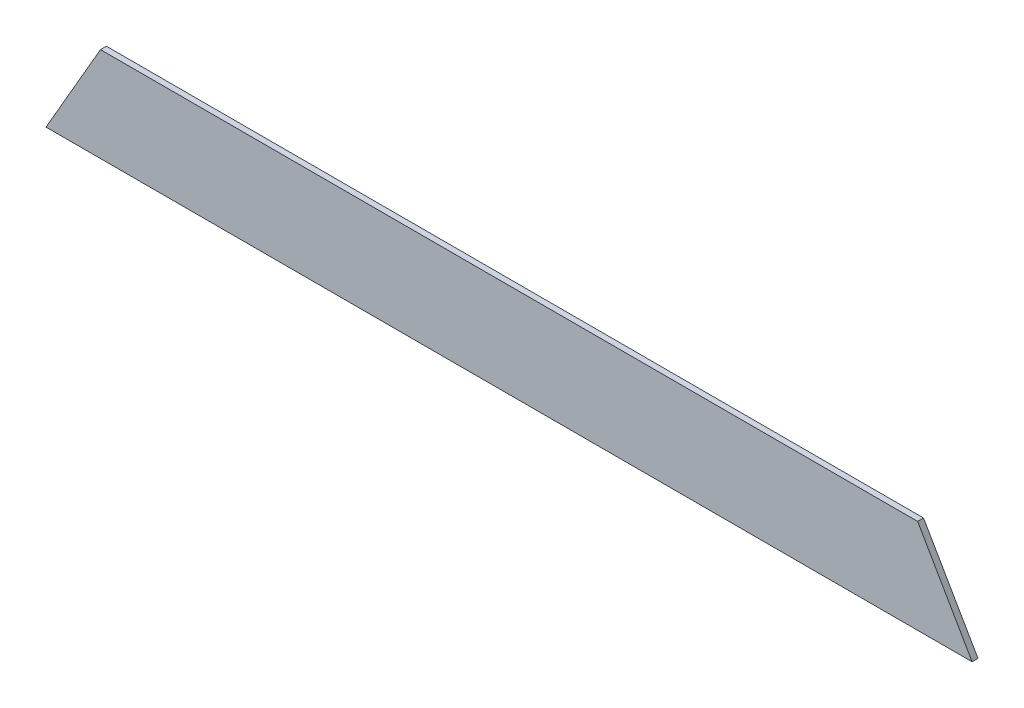
ISO-10303-21;
HEADER;
FILE_DESCRIPTION(('STEP AP214'),'2;1');
FILE_NAME('part.step','',(''),(''),'','','');
FILE_SCHEMA(('AUTOMOTIVE_DESIGN { 1 0 10303 214 1 1 1 1 }'));
ENDSEC;
DATA;
#1=APPLICATION_CONTEXT('core data for automotive mechanical design processes');
#2=APPLICATION_PROTOCOL_DEFINITION('international standard','automotive_design',2000,#1);
#3=PRODUCT_CONTEXT('',#1,'mechanical');
#4=PRODUCT('Part','Part','',(#3));
#5=PRODUCT_RELATED_PRODUCT_CATEGORY('part','',(#4));
#6=PRODUCT_DEFINITION_FORMATION('','',#4);
#7=PRODUCT_DEFINITION_CONTEXT('part definition',#1,'design');
#8=PRODUCT_DEFINITION('design','',#6,#7);
#9=PRODUCT_DEFINITION_SHAPE('','',#8);
#10=(LENGTH_UNIT() NAMED_UNIT(*) SI_UNIT(.MILLI.,.METRE.));
#11=(NAMED_UNIT(*) PLANE_ANGLE_UNIT() SI_UNIT($,.RADIAN.));
#12=(NAMED_UNIT(*) SI_UNIT($,.STERADIAN.) SOLID_ANGLE_UNIT());
#13=UNCERTAINTY_MEASURE_WITH_UNIT(LENGTH_MEASURE(1.E-05),#10,'distance_accuracy_value','');
#14=(GEOMETRIC_REPRESENTATION_CONTEXT(3) GLOBAL_UNCERTAINTY_ASSIGNED_CONTEXT((#13)) GLOBAL_UNIT_ASSIGNED_CONTEXT((#10,
#11,#12)) REPRESENTATION_CONTEXT('',''));
#15=CARTESIAN_POINT('',(0.,0.,0.));
#16=DIRECTION('',(0.,0.,1.));
#17=DIRECTION('',(1.,0.,0.));
#18=AXIS2_PLACEMENT_3D('',#15,#16,#17);
#19=CARTESIAN_POINT('',(0.,0.,3.175));
#20=DIRECTION('',(0.,1.,0.));
#21=DIRECTION('',(0.,0.,1.));
#22=AXIS2_PLACEMENT_3D('',#19,#20,#21);
#23=PLANE('',#22);
#24=DIRECTION('',(1.,0.,0.));
#25=VECTOR('',#24,1.);
#26=CARTESIAN_POINT('',(0.,0.,0.));
#27=LINE('',#26,#25);
#28=CARTESIAN_POINT('',(-29.3293936748326,0.,0.));
#29=VERTEX_POINT('',#28);
#30=CARTESIAN_POINT('',(469.282793674833,0.,0.));
#31=VERTEX_POINT('',#30);
#32=EDGE_CURVE('E80',#29,#31,#27,.T.);
#33=ORIENTED_EDGE('',*,*,#32,.T.);
#34=DIRECTION('',(0.,0.,1.));
#35=VECTOR('',#34,1.);
#36=CARTESIAN_POINT('',(469.282793674833,0.,-58.6587873496658));
#37=LINE('',#36,#35);
#38=CARTESIAN_POINT('',(469.282793674833,0.,3.175));
#39=VERTEX_POINT('',#38);
#40=EDGE_CURVE('E79',#31,#39,#37,.T.);
#41=ORIENTED_EDGE('',*,*,#40,.T.);
#42=DIRECTION('',(1.,0.,0.));
#43=VECTOR('',#42,1.);
#44=CARTESIAN_POINT('',(0.,0.,3.175));
#45=LINE('',#44,#43);
#46=CARTESIAN_POINT('',(-29.3293936748326,0.,3.175));
#47=VERTEX_POINT('',#46);
#48=EDGE_CURVE('E66',#47,#39,#45,.T.);
#49=ORIENTED_EDGE('',*,*,#48,.F.);
#50=DIRECTION('',(0.,0.,1.));
#51=VECTOR('',#50,1.);
#52=CARTESIAN_POINT('',(-29.3293936748326,0.,-58.6587873496658));
#53=LINE('',#52,#51);
#54=EDGE_CURVE('E95',#29,#47,#53,.T.);
#55=ORIENTED_EDGE('',*,*,#54,.F.);
#56=EDGE_LOOP('',(#33,#41,#49,#55));
#57=FACE_BOUND('',#56,.T.);
#58=ADVANCED_FACE('F33',(#57),#23,.F.);
#59=CARTESIAN_POINT('',(0.,50.8,3.175));
#60=DIRECTION('',(0.,-1.,0.));
#61=DIRECTION('',(0.,0.,-1.));
#62=AXIS2_PLACEMENT_3D('',#59,#60,#61);
#63=PLANE('',#62);
#64=DIRECTION('',(-1.,0.,0.));
#65=VECTOR('',#64,1.);
#66=CARTESIAN_POINT('',(0.,50.8,0.));
#67=LINE('',#66,#65);
#68=CARTESIAN_POINT('',(439.9534,50.8,0.));
#69=VERTEX_POINT('',#68);
#70=CARTESIAN_POINT('',(0.,50.8,0.));
#71=VERTEX_POINT('',#70);
#72=EDGE_CURVE('E76',#69,#71,#67,.T.);
#73=ORIENTED_EDGE('',*,*,#72,.T.);
#74=DIRECTION('',(0.,0.,-1.));
#75=VECTOR('',#74,1.);
#76=CARTESIAN_POINT('',(0.,50.8,3.175));
#77=LINE('',#76,#75);
#78=CARTESIAN_POINT('',(0.,50.8,3.175));
#79=VERTEX_POINT('',#78);
#80=EDGE_CURVE('E41',#79,#71,#77,.T.);
#81=ORIENTED_EDGE('',*,*,#80,.F.);
#82=DIRECTION('',(-1.,0.,0.));
#83=VECTOR('',#82,1.);
#84=CARTESIAN_POINT('',(0.,50.8,3.175));
#85=LINE('',#84,#83);
#86=CARTESIAN_POINT('',(439.9534,50.8,3.175));
#87=VERTEX_POINT('',#86);
#88=EDGE_CURVE('E48',#87,#79,#85,.T.);
#89=ORIENTED_EDGE('',*,*,#88,.F.);
#90=DIRECTION('',(0.,0.,-1.));
#91=VECTOR('',#90,1.);
#92=CARTESIAN_POINT('',(439.9534,50.8,3.175));
#93=LINE('',#92,#91);
#94=EDGE_CURVE('E11',#87,#69,#93,.T.);
#95=ORIENTED_EDGE('',*,*,#94,.T.);
#96=EDGE_LOOP('',(#73,#81,#89,#95));
#97=FACE_BOUND('',#96,.T.);
#98=ADVANCED_FACE('F104',(#97),#63,.F.);
#99=CARTESIAN_POINT('',(0.,0.,3.175));
#100=DIRECTION('',(0.,0.,-1.));
#101=DIRECTION('',(-1.,0.,0.));
#102=AXIS2_PLACEMENT_3D('',#99,#100,#101);
#103=PLANE('',#102);
#104=ORIENTED_EDGE('',*,*,#88,.T.);
#105=DIRECTION('',(-0.499999999999995,-0.866025403784442,0.));
#106=VECTOR('',#105,1.);
#107=CARTESIAN_POINT('',(0.,50.8,3.175));
#108=LINE('',#107,#106);
#109=EDGE_CURVE('E72',#79,#47,#108,.T.);
#110=ORIENTED_EDGE('',*,*,#109,.T.);
#111=ORIENTED_EDGE('',*,*,#48,.T.);
#112=DIRECTION('',(-0.499999999999995,0.866025403784441,0.));
#113=VECTOR('',#112,1.);
#114=CARTESIAN_POINT('',(439.9534,50.8,3.175));
#115=LINE('',#114,#113);
#116=EDGE_CURVE('E70',#39,#87,#115,.T.);
#117=ORIENTED_EDGE('',*,*,#116,.T.);
#118=EDGE_LOOP('',(#104,#110,#111,#117));
#119=FACE_BOUND('',#118,.T.);
#120=ADVANCED_FACE('F68',(#119),#103,.F.);
#121=CARTESIAN_POINT('',(0.,0.,0.));
#122=DIRECTION('',(0.,0.,-1.));
#123=DIRECTION('',(-1.,0.,0.));
#124=AXIS2_PLACEMENT_3D('',#121,#122,#123);
#125=PLANE('',#124);
#126=ORIENTED_EDGE('',*,*,#32,.F.);
#127=DIRECTION('',(-0.499999999999995,-0.866025403784442,0.));
#128=VECTOR('',#127,1.);
#129=CARTESIAN_POINT('',(0.,50.8,0.));
#130=LINE('',#129,#128);
#131=EDGE_CURVE('E92',#71,#29,#130,.T.);
#132=ORIENTED_EDGE('',*,*,#131,.F.);
#133=ORIENTED_EDGE('',*,*,#72,.F.);
#134=DIRECTION('',(-0.499999999999995,0.866025403784441,0.));
#135=VECTOR('',#134,1.);
#136=CARTESIAN_POINT('',(439.9534,50.8,0.));
#137=LINE('',#136,#135);
#138=EDGE_CURVE('E84',#31,#69,#137,.T.);
#139=ORIENTED_EDGE('',*,*,#138,.F.);
#140=EDGE_LOOP('',(#126,#132,#133,#139));
#141=FACE_BOUND('',#140,.T.);
#142=ADVANCED_FACE('F107',(#141),#125,.T.);
#143=CARTESIAN_POINT('',(0.,50.8,-58.6587873496658));
#144=DIRECTION('',(-0.866025403784442,0.499999999999995,0.));
#145=DIRECTION('',(-0.499999999999995,-0.866025403784442,0.));
#146=AXIS2_PLACEMENT_3D('',#143,#144,#145);
#147=PLANE('',#146);
#148=ORIENTED_EDGE('',*,*,#80,.T.);
#149=ORIENTED_EDGE('',*,*,#131,.T.);
#150=ORIENTED_EDGE('',*,*,#54,.T.);
#151=ORIENTED_EDGE('',*,*,#109,.F.);
#152=EDGE_LOOP('',(#148,#149,#150,#151));
#153=FACE_BOUND('',#152,.T.);
#154=ADVANCED_FACE('F101',(#153),#147,.T.);
#155=CARTESIAN_POINT('',(439.9534,50.8,-58.6587873496658));
#156=DIRECTION('',(0.866025403784441,0.499999999999995,0.));
#157=DIRECTION('',(-0.499999999999995,0.866025403784441,0.));
#158=AXIS2_PLACEMENT_3D('',#155,#156,#157);
#159=PLANE('',#158);
#160=ORIENTED_EDGE('',*,*,#40,.F.);
#161=ORIENTED_EDGE('',*,*,#138,.T.);
#162=ORIENTED_EDGE('',*,*,#94,.F.);
#163=ORIENTED_EDGE('',*,*,#116,.F.);
#164=EDGE_LOOP('',(#160,#161,#162,#163));
#165=FACE_BOUND('',#164,.T.);
#166=ADVANCED_FACE('F87',(#165),#159,.T.);
#167=CLOSED_SHELL('',(#58,#98,#120,#142,#154,#166));
#168=MANIFOLD_SOLID_BREP('B2',#167);
#169=ADVANCED_BREP_SHAPE_REPRESENTATION('',(#18,#168),#14);
#170=SHAPE_DEFINITION_REPRESENTATION(#9,#169);
ENDSEC;
END-ISO-10303-21;
